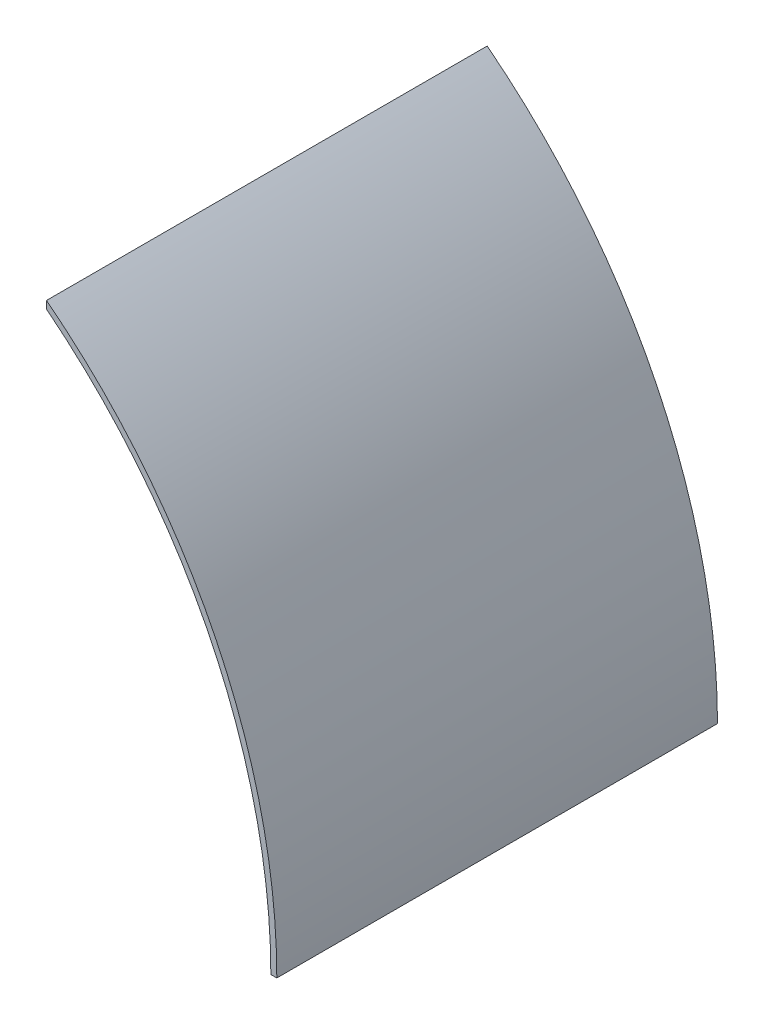
ISO-10303-21;
HEADER;
FILE_DESCRIPTION(('STEP AP214'),'2;1');
FILE_NAME('part.step','',(''),(''),'','','');
FILE_SCHEMA(('AUTOMOTIVE_DESIGN { 1 0 10303 214 1 1 1 1 }'));
ENDSEC;
DATA;
#1=APPLICATION_CONTEXT('core data for automotive mechanical design processes');
#2=APPLICATION_PROTOCOL_DEFINITION('international standard','automotive_design',2000,#1);
#3=PRODUCT_CONTEXT('',#1,'mechanical');
#4=PRODUCT('Part','Part','',(#3));
#5=PRODUCT_RELATED_PRODUCT_CATEGORY('part','',(#4));
#6=PRODUCT_DEFINITION_FORMATION('','',#4);
#7=PRODUCT_DEFINITION_CONTEXT('part definition',#1,'design');
#8=PRODUCT_DEFINITION('design','',#6,#7);
#9=PRODUCT_DEFINITION_SHAPE('','',#8);
#10=(LENGTH_UNIT() NAMED_UNIT(*) SI_UNIT(.MILLI.,.METRE.));
#11=(NAMED_UNIT(*) PLANE_ANGLE_UNIT() SI_UNIT($,.RADIAN.));
#12=(NAMED_UNIT(*) SI_UNIT($,.STERADIAN.) SOLID_ANGLE_UNIT());
#13=UNCERTAINTY_MEASURE_WITH_UNIT(LENGTH_MEASURE(1.E-05),#10,'distance_accuracy_value','');
#14=(GEOMETRIC_REPRESENTATION_CONTEXT(3) GLOBAL_UNCERTAINTY_ASSIGNED_CONTEXT((#13)) GLOBAL_UNIT_ASSIGNED_CONTEXT((#10,
#11,#12)) REPRESENTATION_CONTEXT('',''));
#15=CARTESIAN_POINT('',(0.,0.,0.));
#16=DIRECTION('',(0.,0.,1.));
#17=DIRECTION('',(1.,0.,0.));
#18=AXIS2_PLACEMENT_3D('',#15,#16,#17);
#19=CARTESIAN_POINT('',(0.,0.,112.268));
#20=DIRECTION('',(0.,0.,-1.));
#21=DIRECTION('',(-1.,0.,0.));
#22=AXIS2_PLACEMENT_3D('',#19,#20,#21);
#23=CYLINDRICAL_SURFACE('',#22,150.88108);
#24=CARTESIAN_POINT('',(0.,0.,0.));
#25=DIRECTION('',(0.,0.,-1.));
#26=DIRECTION('',(-1.,0.,0.));
#27=AXIS2_PLACEMENT_3D('',#24,#25,#26);
#28=CIRCLE('',#27,150.88108);
#29=CARTESIAN_POINT('',(93.73108,118.235294831958,0.));
#30=VERTEX_POINT('',#29);
#31=CARTESIAN_POINT('',(150.88108,0.,0.));
#32=VERTEX_POINT('',#31);
#33=EDGE_CURVE('E97',#30,#32,#28,.T.);
#34=ORIENTED_EDGE('',*,*,#33,.T.);
#35=DIRECTION('',(0.,0.,-1.));
#36=VECTOR('',#35,1.);
#37=CARTESIAN_POINT('',(150.88108,0.,112.268));
#38=LINE('',#37,#36);
#39=CARTESIAN_POINT('',(150.88108,0.,112.268));
#40=VERTEX_POINT('',#39);
#41=EDGE_CURVE('E11',#40,#32,#38,.T.);
#42=ORIENTED_EDGE('',*,*,#41,.F.);
#43=CARTESIAN_POINT('',(0.,0.,112.268));
#44=DIRECTION('',(0.,0.,-1.));
#45=DIRECTION('',(-1.,0.,0.));
#46=AXIS2_PLACEMENT_3D('',#43,#44,#45);
#47=CIRCLE('',#46,150.88108);
#48=CARTESIAN_POINT('',(93.73108,118.235294831958,112.268));
#49=VERTEX_POINT('',#48);
#50=EDGE_CURVE('E85',#49,#40,#47,.T.);
#51=ORIENTED_EDGE('',*,*,#50,.F.);
#52=DIRECTION('',(0.,0.,-1.));
#53=VECTOR('',#52,1.);
#54=CARTESIAN_POINT('',(93.73108,118.235294831958,112.268));
#55=LINE('',#54,#53);
#56=EDGE_CURVE('E93',#49,#30,#55,.T.);
#57=ORIENTED_EDGE('',*,*,#56,.T.);
#58=EDGE_LOOP('',(#34,#42,#51,#57));
#59=FACE_BOUND('',#58,.T.);
#60=ADVANCED_FACE('F34',(#59),#23,.F.);
#61=CARTESIAN_POINT('',(150.88108,0.,112.268));
#62=DIRECTION('',(0.,1.,0.));
#63=DIRECTION('',(0.,0.,1.));
#64=AXIS2_PLACEMENT_3D('',#61,#62,#63);
#65=PLANE('',#64);
#66=DIRECTION('',(1.,0.,0.));
#67=VECTOR('',#66,1.);
#68=CARTESIAN_POINT('',(150.88108,0.,0.));
#69=LINE('',#68,#67);
#70=CARTESIAN_POINT('',(152.4,0.,0.));
#71=VERTEX_POINT('',#70);
#72=EDGE_CURVE('E89',#32,#71,#69,.T.);
#73=ORIENTED_EDGE('',*,*,#72,.T.);
#74=DIRECTION('',(0.,0.,-1.));
#75=VECTOR('',#74,1.);
#76=CARTESIAN_POINT('',(152.4,0.,112.268));
#77=LINE('',#76,#75);
#78=CARTESIAN_POINT('',(152.4,0.,112.268));
#79=VERTEX_POINT('',#78);
#80=EDGE_CURVE('E42',#79,#71,#77,.T.);
#81=ORIENTED_EDGE('',*,*,#80,.F.);
#82=DIRECTION('',(1.,0.,0.));
#83=VECTOR('',#82,1.);
#84=CARTESIAN_POINT('',(150.88108,0.,112.268));
#85=LINE('',#84,#83);
#86=EDGE_CURVE('E80',#40,#79,#85,.T.);
#87=ORIENTED_EDGE('',*,*,#86,.F.);
#88=ORIENTED_EDGE('',*,*,#41,.T.);
#89=EDGE_LOOP('',(#73,#81,#87,#88));
#90=FACE_BOUND('',#89,.T.);
#91=ADVANCED_FACE('F88',(#90),#65,.F.);
#92=CARTESIAN_POINT('',(0.,0.,112.268));
#93=DIRECTION('',(0.,0.,-1.));
#94=DIRECTION('',(-1.,0.,0.));
#95=AXIS2_PLACEMENT_3D('',#92,#93,#94);
#96=CYLINDRICAL_SURFACE('',#95,152.4);
#97=CARTESIAN_POINT('',(0.,0.,0.));
#98=DIRECTION('',(0.,0.,1.));
#99=DIRECTION('',(1.,0.,0.));
#100=AXIS2_PLACEMENT_3D('',#97,#98,#99);
#101=CIRCLE('',#100,152.4);
#102=CARTESIAN_POINT('',(93.73108,120.167569011084,0.));
#103=VERTEX_POINT('',#102);
#104=EDGE_CURVE('E67',#71,#103,#101,.T.);
#105=ORIENTED_EDGE('',*,*,#104,.T.);
#106=DIRECTION('',(0.,0.,-1.));
#107=VECTOR('',#106,1.);
#108=CARTESIAN_POINT('',(93.73108,120.167569011084,112.268));
#109=LINE('',#108,#107);
#110=CARTESIAN_POINT('',(93.73108,120.167569011084,112.268));
#111=VERTEX_POINT('',#110);
#112=EDGE_CURVE('E90',#111,#103,#109,.T.);
#113=ORIENTED_EDGE('',*,*,#112,.F.);
#114=CARTESIAN_POINT('',(0.,0.,112.268));
#115=DIRECTION('',(0.,0.,1.));
#116=DIRECTION('',(1.,0.,0.));
#117=AXIS2_PLACEMENT_3D('',#114,#115,#116);
#118=CIRCLE('',#117,152.4);
#119=EDGE_CURVE('E83',#79,#111,#118,.T.);
#120=ORIENTED_EDGE('',*,*,#119,.F.);
#121=ORIENTED_EDGE('',*,*,#80,.T.);
#122=EDGE_LOOP('',(#105,#113,#120,#121));
#123=FACE_BOUND('',#122,.T.);
#124=ADVANCED_FACE('F91',(#123),#96,.T.);
#125=CARTESIAN_POINT('',(93.73108,120.167569011084,112.268));
#126=DIRECTION('',(1.,0.,0.));
#127=DIRECTION('',(0.,1.,0.));
#128=AXIS2_PLACEMENT_3D('',#125,#126,#127);
#129=PLANE('',#128);
#130=DIRECTION('',(0.,-1.,0.));
#131=VECTOR('',#130,1.);
#132=CARTESIAN_POINT('',(93.73108,120.167569011084,0.));
#133=LINE('',#132,#131);
#134=EDGE_CURVE('E73',#103,#30,#133,.T.);
#135=ORIENTED_EDGE('',*,*,#134,.T.);
#136=ORIENTED_EDGE('',*,*,#56,.F.);
#137=DIRECTION('',(0.,-1.,0.));
#138=VECTOR('',#137,1.);
#139=CARTESIAN_POINT('',(93.73108,120.167569011084,112.268));
#140=LINE('',#139,#138);
#141=EDGE_CURVE('E50',#111,#49,#140,.T.);
#142=ORIENTED_EDGE('',*,*,#141,.F.);
#143=ORIENTED_EDGE('',*,*,#112,.T.);
#144=EDGE_LOOP('',(#135,#136,#142,#143));
#145=FACE_BOUND('',#144,.T.);
#146=ADVANCED_FACE('F104',(#145),#129,.F.);
#147=CARTESIAN_POINT('',(0.,0.,112.268));
#148=DIRECTION('',(0.,0.,-1.));
#149=DIRECTION('',(-1.,0.,0.));
#150=AXIS2_PLACEMENT_3D('',#147,#148,#149);
#151=PLANE('',#150);
#152=ORIENTED_EDGE('',*,*,#50,.T.);
#153=ORIENTED_EDGE('',*,*,#86,.T.);
#154=ORIENTED_EDGE('',*,*,#119,.T.);
#155=ORIENTED_EDGE('',*,*,#141,.T.);
#156=EDGE_LOOP('',(#152,#153,#154,#155));
#157=FACE_BOUND('',#156,.T.);
#158=ADVANCED_FACE('F81',(#157),#151,.F.);
#159=CARTESIAN_POINT('',(0.,0.,0.));
#160=DIRECTION('',(0.,0.,-1.));
#161=DIRECTION('',(-1.,0.,0.));
#162=AXIS2_PLACEMENT_3D('',#159,#160,#161);
#163=PLANE('',#162);
#164=ORIENTED_EDGE('',*,*,#33,.F.);
#165=ORIENTED_EDGE('',*,*,#134,.F.);
#166=ORIENTED_EDGE('',*,*,#104,.F.);
#167=ORIENTED_EDGE('',*,*,#72,.F.);
#168=EDGE_LOOP('',(#164,#165,#166,#167));
#169=FACE_BOUND('',#168,.T.);
#170=ADVANCED_FACE('F107',(#169),#163,.T.);
#171=CLOSED_SHELL('',(#60,#91,#124,#146,#158,#170));
#172=MANIFOLD_SOLID_BREP('B2',#171);
#173=ADVANCED_BREP_SHAPE_REPRESENTATION('',(#18,#172),#14);
#174=SHAPE_DEFINITION_REPRESENTATION(#9,#173);
ENDSEC;
END-ISO-10303-21;
